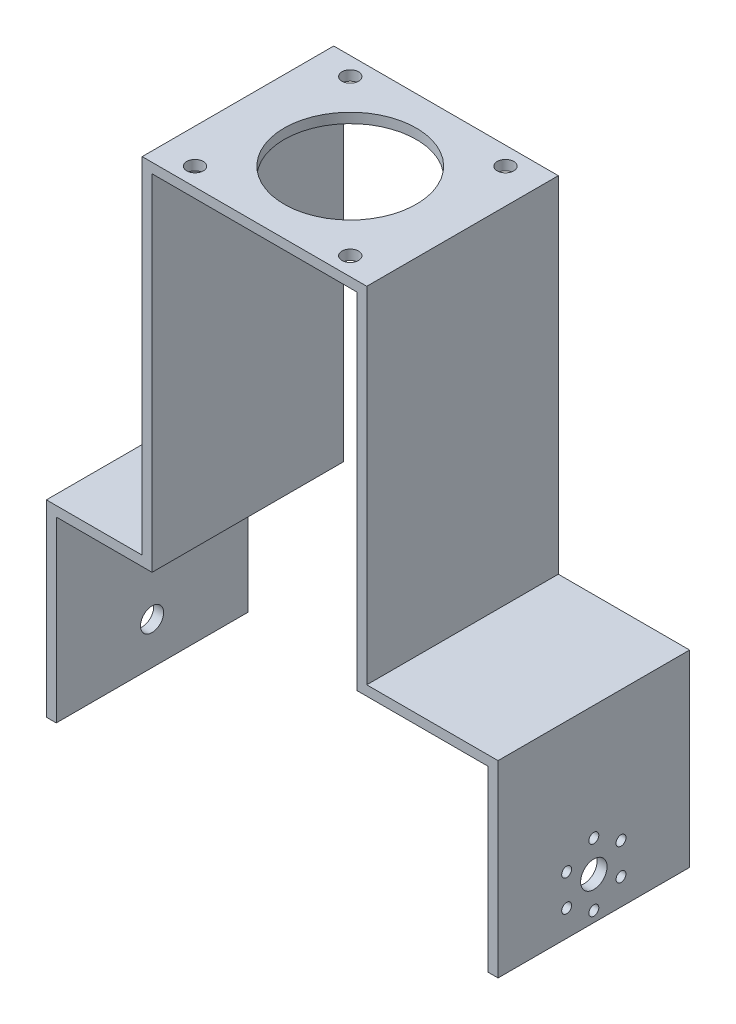
ISO-10303-21;
HEADER;
FILE_DESCRIPTION(('STEP AP214'),'2;1');
FILE_NAME('part.step','',(''),(''),'','','');
FILE_SCHEMA(('AUTOMOTIVE_DESIGN { 1 0 10303 214 1 1 1 1 }'));
ENDSEC;
DATA;
#1=APPLICATION_CONTEXT('core data for automotive mechanical design processes');
#2=APPLICATION_PROTOCOL_DEFINITION('international standard','automotive_design',2000,#1);
#3=PRODUCT_CONTEXT('',#1,'mechanical');
#4=PRODUCT('Part','Part','',(#3));
#5=PRODUCT_RELATED_PRODUCT_CATEGORY('part','',(#4));
#6=PRODUCT_DEFINITION_FORMATION('','',#4);
#7=PRODUCT_DEFINITION_CONTEXT('part definition',#1,'design');
#8=PRODUCT_DEFINITION('design','',#6,#7);
#9=PRODUCT_DEFINITION_SHAPE('','',#8);
#10=(LENGTH_UNIT() NAMED_UNIT(*) SI_UNIT(.MILLI.,.METRE.));
#11=(NAMED_UNIT(*) PLANE_ANGLE_UNIT() SI_UNIT($,.RADIAN.));
#12=(NAMED_UNIT(*) SI_UNIT($,.STERADIAN.) SOLID_ANGLE_UNIT());
#13=UNCERTAINTY_MEASURE_WITH_UNIT(LENGTH_MEASURE(1.E-05),#10,'distance_accuracy_value','');
#14=(GEOMETRIC_REPRESENTATION_CONTEXT(3) GLOBAL_UNCERTAINTY_ASSIGNED_CONTEXT((#13)) GLOBAL_UNIT_ASSIGNED_CONTEXT((#10,
#11,#12)) REPRESENTATION_CONTEXT('',''));
#15=CARTESIAN_POINT('',(0.,0.,0.));
#16=DIRECTION('',(0.,0.,1.));
#17=DIRECTION('',(1.,0.,0.));
#18=AXIS2_PLACEMENT_3D('',#15,#16,#17);
#19=CARTESIAN_POINT('',(-32.,51.8967154618484,58.));
#20=DIRECTION('',(1.,0.,0.));
#21=DIRECTION('',(0.,1.,0.));
#22=AXIS2_PLACEMENT_3D('',#19,#20,#21);
#23=PLANE('',#22);
#24=DIRECTION('',(0.,-1.,0.));
#25=VECTOR('',#24,1.);
#26=CARTESIAN_POINT('',(-32.,51.8967154618484,0.));
#27=LINE('',#26,#25);
#28=CARTESIAN_POINT('',(-32.,51.8967154618484,0.));
#29=VERTEX_POINT('',#28);
#30=CARTESIAN_POINT('',(-32.,-52.6032845381516,0.));
#31=VERTEX_POINT('',#30);
#32=EDGE_CURVE('E182',#29,#31,#27,.T.);
#33=ORIENTED_EDGE('',*,*,#32,.T.);
#34=DIRECTION('',(0.,0.,-1.));
#35=VECTOR('',#34,1.);
#36=CARTESIAN_POINT('',(-32.,-52.6032845381516,58.));
#37=LINE('',#36,#35);
#38=CARTESIAN_POINT('',(-32.,-52.6032845381516,58.));
#39=VERTEX_POINT('',#38);
#40=EDGE_CURVE('E42',#39,#31,#37,.T.);
#41=ORIENTED_EDGE('',*,*,#40,.F.);
#42=DIRECTION('',(0.,-1.,0.));
#43=VECTOR('',#42,1.);
#44=CARTESIAN_POINT('',(-32.,51.8967154618484,58.));
#45=LINE('',#44,#43);
#46=CARTESIAN_POINT('',(-32.,51.8967154618484,58.));
#47=VERTEX_POINT('',#46);
#48=EDGE_CURVE('E118',#47,#39,#45,.T.);
#49=ORIENTED_EDGE('',*,*,#48,.F.);
#50=DIRECTION('',(0.,0.,-1.));
#51=VECTOR('',#50,1.);
#52=CARTESIAN_POINT('',(-32.,51.8967154618484,58.));
#53=LINE('',#52,#51);
#54=EDGE_CURVE('E11',#47,#29,#53,.T.);
#55=ORIENTED_EDGE('',*,*,#54,.T.);
#56=EDGE_LOOP('',(#33,#41,#49,#55));
#57=FACE_BOUND('',#56,.T.);
#58=ADVANCED_FACE('F33',(#57),#23,.F.);
#59=CARTESIAN_POINT('',(-32.,-52.6032845381516,58.));
#60=DIRECTION('',(0.,-1.,0.));
#61=DIRECTION('',(1.,0.,0.));
#62=AXIS2_PLACEMENT_3D('',#59,#60,#61);
#63=PLANE('',#62);
#64=DIRECTION('',(-1.,0.,0.));
#65=VECTOR('',#64,1.);
#66=CARTESIAN_POINT('',(-32.,-52.6032845381516,0.));
#67=LINE('',#66,#65);
#68=CARTESIAN_POINT('',(-61.,-52.6032845381516,0.));
#69=VERTEX_POINT('',#68);
#70=EDGE_CURVE('E184',#31,#69,#67,.T.);
#71=ORIENTED_EDGE('',*,*,#70,.T.);
#72=DIRECTION('',(0.,0.,-1.));
#73=VECTOR('',#72,1.);
#74=CARTESIAN_POINT('',(-61.,-52.6032845381516,58.));
#75=LINE('',#74,#73);
#76=CARTESIAN_POINT('',(-61.,-52.6032845381516,58.));
#77=VERTEX_POINT('',#76);
#78=EDGE_CURVE('E242',#77,#69,#75,.T.);
#79=ORIENTED_EDGE('',*,*,#78,.F.);
#80=DIRECTION('',(-1.,0.,0.));
#81=VECTOR('',#80,1.);
#82=CARTESIAN_POINT('',(-32.,-52.6032845381516,58.));
#83=LINE('',#82,#81);
#84=EDGE_CURVE('E251',#39,#77,#83,.T.);
#85=ORIENTED_EDGE('',*,*,#84,.F.);
#86=ORIENTED_EDGE('',*,*,#40,.T.);
#87=EDGE_LOOP('',(#71,#79,#85,#86));
#88=FACE_BOUND('',#87,.T.);
#89=ADVANCED_FACE('F249',(#88),#63,.F.);
#90=CARTESIAN_POINT('',(-61.,-52.6032845381516,58.));
#91=DIRECTION('',(1.,0.,0.));
#92=DIRECTION('',(0.,0.,-1.));
#93=AXIS2_PLACEMENT_3D('',#90,#91,#92);
#94=PLANE('',#93);
#95=CARTESIAN_POINT('',(-61.,-96.9032845381516,29.));
#96=DIRECTION('',(-1.,0.,0.));
#97=DIRECTION('',(0.,0.,1.));
#98=AXIS2_PLACEMENT_3D('',#95,#96,#97);
#99=CIRCLE('',#98,3.5);
#100=CARTESIAN_POINT('',(-61.,-96.9032845381516,32.5));
#101=VERTEX_POINT('',#100);
#102=EDGE_CURVE('E302',#101,#101,#99,.T.);
#103=ORIENTED_EDGE('',*,*,#102,.F.);
#104=EDGE_LOOP('',(#103));
#105=FACE_BOUND('',#104,.T.);
#106=DIRECTION('',(0.,-1.,0.));
#107=VECTOR('',#106,1.);
#108=CARTESIAN_POINT('',(-61.,-52.6032845381516,0.));
#109=LINE('',#108,#107);
#110=CARTESIAN_POINT('',(-61.,-109.603284538152,0.));
#111=VERTEX_POINT('',#110);
#112=EDGE_CURVE('E186',#69,#111,#109,.T.);
#113=ORIENTED_EDGE('',*,*,#112,.T.);
#114=DIRECTION('',(0.,0.,-1.));
#115=VECTOR('',#114,1.);
#116=CARTESIAN_POINT('',(-61.,-109.603284538152,58.));
#117=LINE('',#116,#115);
#118=CARTESIAN_POINT('',(-61.,-109.603284538152,58.));
#119=VERTEX_POINT('',#118);
#120=EDGE_CURVE('E239',#119,#111,#117,.T.);
#121=ORIENTED_EDGE('',*,*,#120,.F.);
#122=DIRECTION('',(0.,-1.,0.));
#123=VECTOR('',#122,1.);
#124=CARTESIAN_POINT('',(-61.,-52.6032845381516,58.));
#125=LINE('',#124,#123);
#126=EDGE_CURVE('E270',#77,#119,#125,.T.);
#127=ORIENTED_EDGE('',*,*,#126,.F.);
#128=ORIENTED_EDGE('',*,*,#78,.T.);
#129=EDGE_LOOP('',(#113,#121,#127,#128));
#130=FACE_BOUND('',#129,.T.);
#131=ADVANCED_FACE('F261',(#105,#130),#94,.F.);
#132=CARTESIAN_POINT('',(-61.,-109.603284538152,58.));
#133=DIRECTION('',(0.,1.,0.));
#134=DIRECTION('',(0.,0.,1.));
#135=AXIS2_PLACEMENT_3D('',#132,#133,#134);
#136=PLANE('',#135);
#137=DIRECTION('',(1.,0.,0.));
#138=VECTOR('',#137,1.);
#139=CARTESIAN_POINT('',(-61.,-109.603284538152,0.));
#140=LINE('',#139,#138);
#141=CARTESIAN_POINT('',(-58.,-109.603284538152,0.));
#142=VERTEX_POINT('',#141);
#143=EDGE_CURVE('E188',#111,#142,#140,.T.);
#144=ORIENTED_EDGE('',*,*,#143,.T.);
#145=DIRECTION('',(0.,0.,-1.));
#146=VECTOR('',#145,1.);
#147=CARTESIAN_POINT('',(-58.,-109.603284538152,58.));
#148=LINE('',#147,#146);
#149=CARTESIAN_POINT('',(-58.,-109.603284538152,58.));
#150=VERTEX_POINT('',#149);
#151=EDGE_CURVE('E236',#150,#142,#148,.T.);
#152=ORIENTED_EDGE('',*,*,#151,.F.);
#153=DIRECTION('',(1.,0.,0.));
#154=VECTOR('',#153,1.);
#155=CARTESIAN_POINT('',(-61.,-109.603284538152,58.));
#156=LINE('',#155,#154);
#157=EDGE_CURVE('E267',#119,#150,#156,.T.);
#158=ORIENTED_EDGE('',*,*,#157,.F.);
#159=ORIENTED_EDGE('',*,*,#120,.T.);
#160=EDGE_LOOP('',(#144,#152,#158,#159));
#161=FACE_BOUND('',#160,.T.);
#162=ADVANCED_FACE('F265',(#161),#136,.F.);
#163=CARTESIAN_POINT('',(-58.,-55.6032845381516,58.));
#164=DIRECTION('',(-1.,0.,0.));
#165=DIRECTION('',(0.,0.,1.));
#166=AXIS2_PLACEMENT_3D('',#163,#164,#165);
#167=PLANE('',#166);
#168=CARTESIAN_POINT('',(-58.,-96.9032845381516,29.));
#169=DIRECTION('',(-1.,0.,0.));
#170=DIRECTION('',(0.,0.,1.));
#171=AXIS2_PLACEMENT_3D('',#168,#169,#170);
#172=CIRCLE('',#171,3.5);
#173=CARTESIAN_POINT('',(-58.,-96.9032845381516,32.5));
#174=VERTEX_POINT('',#173);
#175=EDGE_CURVE('E36',#174,#174,#172,.T.);
#176=ORIENTED_EDGE('',*,*,#175,.T.);
#177=EDGE_LOOP('',(#176));
#178=FACE_BOUND('',#177,.T.);
#179=DIRECTION('',(0.,1.,0.));
#180=VECTOR('',#179,1.);
#181=CARTESIAN_POINT('',(-58.,-55.6032845381516,0.));
#182=LINE('',#181,#180);
#183=CARTESIAN_POINT('',(-58.,-55.6032845381516,0.));
#184=VERTEX_POINT('',#183);
#185=EDGE_CURVE('E190',#142,#184,#182,.T.);
#186=ORIENTED_EDGE('',*,*,#185,.T.);
#187=DIRECTION('',(0.,0.,-1.));
#188=VECTOR('',#187,1.);
#189=CARTESIAN_POINT('',(-58.,-55.6032845381516,58.));
#190=LINE('',#189,#188);
#191=CARTESIAN_POINT('',(-58.,-55.6032845381516,58.));
#192=VERTEX_POINT('',#191);
#193=EDGE_CURVE('E233',#192,#184,#190,.T.);
#194=ORIENTED_EDGE('',*,*,#193,.F.);
#195=DIRECTION('',(0.,1.,0.));
#196=VECTOR('',#195,1.);
#197=CARTESIAN_POINT('',(-58.,-55.6032845381516,58.));
#198=LINE('',#197,#196);
#199=EDGE_CURVE('E269',#150,#192,#198,.T.);
#200=ORIENTED_EDGE('',*,*,#199,.F.);
#201=ORIENTED_EDGE('',*,*,#151,.T.);
#202=EDGE_LOOP('',(#186,#194,#200,#201));
#203=FACE_BOUND('',#202,.T.);
#204=ADVANCED_FACE('F439',(#178,#203),#167,.F.);
#205=CARTESIAN_POINT('',(-29.,-55.6032845381516,58.));
#206=DIRECTION('',(0.,1.,0.));
#207=DIRECTION('',(-1.,0.,0.));
#208=AXIS2_PLACEMENT_3D('',#205,#206,#207);
#209=PLANE('',#208);
#210=DIRECTION('',(1.,0.,0.));
#211=VECTOR('',#210,1.);
#212=CARTESIAN_POINT('',(-29.,-55.6032845381516,0.));
#213=LINE('',#212,#211);
#214=CARTESIAN_POINT('',(-29.,-55.6032845381516,0.));
#215=VERTEX_POINT('',#214);
#216=EDGE_CURVE('E192',#184,#215,#213,.T.);
#217=ORIENTED_EDGE('',*,*,#216,.T.);
#218=DIRECTION('',(0.,0.,-1.));
#219=VECTOR('',#218,1.);
#220=CARTESIAN_POINT('',(-29.,-55.6032845381516,58.));
#221=LINE('',#220,#219);
#222=CARTESIAN_POINT('',(-29.,-55.6032845381516,58.));
#223=VERTEX_POINT('',#222);
#224=EDGE_CURVE('E230',#223,#215,#221,.T.);
#225=ORIENTED_EDGE('',*,*,#224,.F.);
#226=DIRECTION('',(1.,0.,0.));
#227=VECTOR('',#226,1.);
#228=CARTESIAN_POINT('',(-29.,-55.6032845381516,58.));
#229=LINE('',#228,#227);
#230=EDGE_CURVE('E272',#192,#223,#229,.T.);
#231=ORIENTED_EDGE('',*,*,#230,.F.);
#232=ORIENTED_EDGE('',*,*,#193,.T.);
#233=EDGE_LOOP('',(#217,#225,#231,#232));
#234=FACE_BOUND('',#233,.T.);
#235=ADVANCED_FACE('F442',(#234),#209,.F.);
#236=CARTESIAN_POINT('',(-29.,48.8967154618484,58.));
#237=DIRECTION('',(-1.,0.,0.));
#238=DIRECTION('',(0.,-1.,0.));
#239=AXIS2_PLACEMENT_3D('',#236,#237,#238);
#240=PLANE('',#239);
#241=DIRECTION('',(0.,1.,0.));
#242=VECTOR('',#241,1.);
#243=CARTESIAN_POINT('',(-29.,48.8967154618484,0.));
#244=LINE('',#243,#242);
#245=CARTESIAN_POINT('',(-29.,48.8967154618484,0.));
#246=VERTEX_POINT('',#245);
#247=EDGE_CURVE('E194',#215,#246,#244,.T.);
#248=ORIENTED_EDGE('',*,*,#247,.T.);
#249=DIRECTION('',(0.,0.,-1.));
#250=VECTOR('',#249,1.);
#251=CARTESIAN_POINT('',(-29.,48.8967154618484,58.));
#252=LINE('',#251,#250);
#253=CARTESIAN_POINT('',(-29.,48.8967154618484,58.));
#254=VERTEX_POINT('',#253);
#255=EDGE_CURVE('E227',#254,#246,#252,.T.);
#256=ORIENTED_EDGE('',*,*,#255,.F.);
#257=DIRECTION('',(0.,1.,0.));
#258=VECTOR('',#257,1.);
#259=CARTESIAN_POINT('',(-29.,48.8967154618484,58.));
#260=LINE('',#259,#258);
#261=EDGE_CURVE('E278',#223,#254,#260,.T.);
#262=ORIENTED_EDGE('',*,*,#261,.F.);
#263=ORIENTED_EDGE('',*,*,#224,.T.);
#264=EDGE_LOOP('',(#248,#256,#262,#263));
#265=FACE_BOUND('',#264,.T.);
#266=ADVANCED_FACE('F404',(#265),#240,.F.);
#267=CARTESIAN_POINT('',(1.99999999999999,48.8967154618484,58.));
#268=DIRECTION('',(0.,1.,0.));
#269=DIRECTION('',(0.,0.,1.));
#270=AXIS2_PLACEMENT_3D('',#267,#268,#269);
#271=PLANE('',#270);
#272=CARTESIAN_POINT('',(-21.5,48.8967154618484,52.5));
#273=DIRECTION('',(0.,1.,0.));
#274=DIRECTION('',(0.,0.,1.));
#275=AXIS2_PLACEMENT_3D('',#272,#273,#274);
#276=CIRCLE('',#275,2.5);
#277=CARTESIAN_POINT('',(-21.5,48.8967154618484,55.));
#278=VERTEX_POINT('',#277);
#279=EDGE_CURVE('E371',#278,#278,#276,.T.);
#280=ORIENTED_EDGE('',*,*,#279,.T.);
#281=EDGE_LOOP('',(#280));
#282=FACE_BOUND('',#281,.T.);
#283=CARTESIAN_POINT('',(25.4999999999999,48.8967154618484,52.5));
#284=DIRECTION('',(0.,1.,0.));
#285=DIRECTION('',(0.,0.,1.));
#286=AXIS2_PLACEMENT_3D('',#283,#284,#285);
#287=CIRCLE('',#286,2.5);
#288=CARTESIAN_POINT('',(25.4999999999999,48.8967154618484,55.));
#289=VERTEX_POINT('',#288);
#290=EDGE_CURVE('E365',#289,#289,#287,.T.);
#291=ORIENTED_EDGE('',*,*,#290,.T.);
#292=EDGE_LOOP('',(#291));
#293=FACE_BOUND('',#292,.T.);
#294=CARTESIAN_POINT('',(25.4999999999999,48.8967154618484,5.5));
#295=DIRECTION('',(0.,1.,0.));
#296=DIRECTION('',(0.,0.,1.));
#297=AXIS2_PLACEMENT_3D('',#294,#295,#296);
#298=CIRCLE('',#297,2.5);
#299=CARTESIAN_POINT('',(25.4999999999999,48.8967154618484,7.99999999999999));
#300=VERTEX_POINT('',#299);
#301=EDGE_CURVE('E359',#300,#300,#298,.T.);
#302=ORIENTED_EDGE('',*,*,#301,.T.);
#303=EDGE_LOOP('',(#302));
#304=FACE_BOUND('',#303,.T.);
#305=CARTESIAN_POINT('',(-21.5,48.8967154618484,5.5));
#306=DIRECTION('',(0.,1.,0.));
#307=DIRECTION('',(0.,0.,1.));
#308=AXIS2_PLACEMENT_3D('',#305,#306,#307);
#309=CIRCLE('',#308,2.5);
#310=CARTESIAN_POINT('',(-21.5,48.8967154618484,8.));
#311=VERTEX_POINT('',#310);
#312=EDGE_CURVE('E353',#311,#311,#309,.T.);
#313=ORIENTED_EDGE('',*,*,#312,.T.);
#314=EDGE_LOOP('',(#313));
#315=FACE_BOUND('',#314,.T.);
#316=CARTESIAN_POINT('',(1.99999999999998,48.8967154618484,29.));
#317=DIRECTION('',(0.,1.,0.));
#318=DIRECTION('',(0.,0.,1.));
#319=AXIS2_PLACEMENT_3D('',#316,#317,#318);
#320=CIRCLE('',#319,20.);
#321=CARTESIAN_POINT('',(1.99999999999998,48.8967154618484,49.));
#322=VERTEX_POINT('',#321);
#323=EDGE_CURVE('E347',#322,#322,#320,.T.);
#324=ORIENTED_EDGE('',*,*,#323,.T.);
#325=EDGE_LOOP('',(#324));
#326=FACE_BOUND('',#325,.T.);
#327=DIRECTION('',(1.,0.,0.));
#328=VECTOR('',#327,1.);
#329=CARTESIAN_POINT('',(1.99999999999999,48.8967154618484,0.));
#330=LINE('',#329,#328);
#331=CARTESIAN_POINT('',(33.,48.8967154618484,0.));
#332=VERTEX_POINT('',#331);
#333=EDGE_CURVE('E197',#246,#332,#330,.T.);
#334=ORIENTED_EDGE('',*,*,#333,.T.);
#335=DIRECTION('',(0.,0.,-1.));
#336=VECTOR('',#335,1.);
#337=CARTESIAN_POINT('',(33.,48.8967154618484,58.));
#338=LINE('',#337,#336);
#339=CARTESIAN_POINT('',(33.,48.8967154618484,58.));
#340=VERTEX_POINT('',#339);
#341=EDGE_CURVE('E224',#340,#332,#338,.T.);
#342=ORIENTED_EDGE('',*,*,#341,.F.);
#343=DIRECTION('',(1.,0.,0.));
#344=VECTOR('',#343,1.);
#345=CARTESIAN_POINT('',(1.99999999999999,48.8967154618484,58.));
#346=LINE('',#345,#344);
#347=EDGE_CURVE('E280',#254,#340,#346,.T.);
#348=ORIENTED_EDGE('',*,*,#347,.F.);
#349=ORIENTED_EDGE('',*,*,#255,.T.);
#350=EDGE_LOOP('',(#334,#342,#348,#349));
#351=FACE_BOUND('',#350,.T.);
#352=ADVANCED_FACE('F400',(#282,#293,#304,#315,#326,#351),#271,.F.);
#353=CARTESIAN_POINT('',(33.,48.8967154618484,58.));
#354=DIRECTION('',(1.,0.,0.));
#355=DIRECTION('',(0.,1.,0.));
#356=AXIS2_PLACEMENT_3D('',#353,#354,#355);
#357=PLANE('',#356);
#358=DIRECTION('',(0.,-1.,0.));
#359=VECTOR('',#358,1.);
#360=CARTESIAN_POINT('',(33.,48.8967154618484,0.));
#361=LINE('',#360,#359);
#362=CARTESIAN_POINT('',(33.,-55.6032845381516,0.));
#363=VERTEX_POINT('',#362);
#364=EDGE_CURVE('E199',#332,#363,#361,.T.);
#365=ORIENTED_EDGE('',*,*,#364,.T.);
#366=DIRECTION('',(0.,0.,-1.));
#367=VECTOR('',#366,1.);
#368=CARTESIAN_POINT('',(33.,-55.6032845381516,58.));
#369=LINE('',#368,#367);
#370=CARTESIAN_POINT('',(33.,-55.6032845381516,58.));
#371=VERTEX_POINT('',#370);
#372=EDGE_CURVE('E221',#371,#363,#369,.T.);
#373=ORIENTED_EDGE('',*,*,#372,.F.);
#374=DIRECTION('',(0.,-1.,0.));
#375=VECTOR('',#374,1.);
#376=CARTESIAN_POINT('',(33.,48.8967154618484,58.));
#377=LINE('',#376,#375);
#378=EDGE_CURVE('E282',#340,#371,#377,.T.);
#379=ORIENTED_EDGE('',*,*,#378,.F.);
#380=ORIENTED_EDGE('',*,*,#341,.T.);
#381=EDGE_LOOP('',(#365,#373,#379,#380));
#382=FACE_BOUND('',#381,.T.);
#383=ADVANCED_FACE('F403',(#382),#357,.F.);
#384=CARTESIAN_POINT('',(33.,-55.6032845381516,58.));
#385=DIRECTION('',(0.,1.,0.));
#386=DIRECTION('',(0.,0.,1.));
#387=AXIS2_PLACEMENT_3D('',#384,#385,#386);
#388=PLANE('',#387);
#389=DIRECTION('',(1.,0.,0.));
#390=VECTOR('',#389,1.);
#391=CARTESIAN_POINT('',(33.,-55.6032845381516,0.));
#392=LINE('',#391,#390);
#393=CARTESIAN_POINT('',(72.75,-55.6032845381516,0.));
#394=VERTEX_POINT('',#393);
#395=EDGE_CURVE('E201',#363,#394,#392,.T.);
#396=ORIENTED_EDGE('',*,*,#395,.T.);
#397=DIRECTION('',(0.,0.,-1.));
#398=VECTOR('',#397,1.);
#399=CARTESIAN_POINT('',(72.75,-55.6032845381516,58.));
#400=LINE('',#399,#398);
#401=CARTESIAN_POINT('',(72.75,-55.6032845381516,58.));
#402=VERTEX_POINT('',#401);
#403=EDGE_CURVE('E218',#402,#394,#400,.T.);
#404=ORIENTED_EDGE('',*,*,#403,.F.);
#405=DIRECTION('',(1.,0.,0.));
#406=VECTOR('',#405,1.);
#407=CARTESIAN_POINT('',(33.,-55.6032845381516,58.));
#408=LINE('',#407,#406);
#409=EDGE_CURVE('E284',#371,#402,#408,.T.);
#410=ORIENTED_EDGE('',*,*,#409,.F.);
#411=ORIENTED_EDGE('',*,*,#372,.T.);
#412=EDGE_LOOP('',(#396,#404,#410,#411));
#413=FACE_BOUND('',#412,.T.);
#414=ADVANCED_FACE('F417',(#413),#388,.F.);
#415=CARTESIAN_POINT('',(72.75,-55.6032845381516,58.));
#416=DIRECTION('',(1.,0.,0.));
#417=DIRECTION('',(0.,1.,0.));
#418=AXIS2_PLACEMENT_3D('',#415,#416,#417);
#419=PLANE('',#418);
#420=CARTESIAN_POINT('',(72.75,-92.1524399232922,37.2272413359512));
#421=DIRECTION('',(1.,0.,0.));
#422=DIRECTION('',(0.,1.,0.));
#423=AXIS2_PLACEMENT_3D('',#420,#421,#422);
#424=CIRCLE('',#423,1.5);
#425=CARTESIAN_POINT('',(72.75,-90.6524399232922,37.2272413359512));
#426=VERTEX_POINT('',#425);
#427=EDGE_CURVE('E341',#426,#426,#424,.T.);
#428=ORIENTED_EDGE('',*,*,#427,.T.);
#429=EDGE_LOOP('',(#428));
#430=FACE_BOUND('',#429,.T.);
#431=CARTESIAN_POINT('',(72.75,-101.652439923292,37.2272413359495));
#432=DIRECTION('',(1.,0.,0.));
#433=DIRECTION('',(0.,1.,0.));
#434=AXIS2_PLACEMENT_3D('',#431,#432,#433);
#435=CIRCLE('',#434,1.5);
#436=CARTESIAN_POINT('',(72.75,-100.152439923292,37.2272413359495));
#437=VERTEX_POINT('',#436);
#438=EDGE_CURVE('E335',#437,#437,#435,.T.);
#439=ORIENTED_EDGE('',*,*,#438,.T.);
#440=EDGE_LOOP('',(#439));
#441=FACE_BOUND('',#440,.T.);
#442=CARTESIAN_POINT('',(72.75,-106.402439923291,28.9999999999964));
#443=DIRECTION('',(1.,0.,0.));
#444=DIRECTION('',(0.,1.,0.));
#445=AXIS2_PLACEMENT_3D('',#442,#443,#444);
#446=CIRCLE('',#445,1.5);
#447=CARTESIAN_POINT('',(72.75,-104.902439923291,28.9999999999964));
#448=VERTEX_POINT('',#447);
#449=EDGE_CURVE('E329',#448,#448,#446,.T.);
#450=ORIENTED_EDGE('',*,*,#449,.T.);
#451=EDGE_LOOP('',(#450));
#452=FACE_BOUND('',#451,.T.);
#453=CARTESIAN_POINT('',(72.75,-101.652439923289,20.7727586640451));
#454=DIRECTION('',(1.,0.,0.));
#455=DIRECTION('',(0.,1.,0.));
#456=AXIS2_PLACEMENT_3D('',#453,#454,#455);
#457=CIRCLE('',#456,1.5);
#458=CARTESIAN_POINT('',(72.75,-100.152439923289,20.7727586640451));
#459=VERTEX_POINT('',#458);
#460=EDGE_CURVE('E323',#459,#459,#457,.T.);
#461=ORIENTED_EDGE('',*,*,#460,.T.);
#462=EDGE_LOOP('',(#461));
#463=FACE_BOUND('',#462,.T.);
#464=CARTESIAN_POINT('',(72.75,-92.1524399232892,20.7727586640469));
#465=DIRECTION('',(1.,0.,0.));
#466=DIRECTION('',(0.,1.,0.));
#467=AXIS2_PLACEMENT_3D('',#464,#465,#466);
#468=CIRCLE('',#467,1.5);
#469=CARTESIAN_POINT('',(72.75,-90.6524399232892,20.7727586640469));
#470=VERTEX_POINT('',#469);
#471=EDGE_CURVE('E317',#470,#470,#468,.T.);
#472=ORIENTED_EDGE('',*,*,#471,.T.);
#473=EDGE_LOOP('',(#472));
#474=FACE_BOUND('',#473,.T.);
#475=CARTESIAN_POINT('',(72.75,-87.4024399232907,29.));
#476=DIRECTION('',(1.,0.,0.));
#477=DIRECTION('',(0.,1.,0.));
#478=AXIS2_PLACEMENT_3D('',#475,#476,#477);
#479=CIRCLE('',#478,1.5);
#480=CARTESIAN_POINT('',(72.75,-85.9024399232907,29.));
#481=VERTEX_POINT('',#480);
#482=EDGE_CURVE('E311',#481,#481,#479,.T.);
#483=ORIENTED_EDGE('',*,*,#482,.T.);
#484=EDGE_LOOP('',(#483));
#485=FACE_BOUND('',#484,.T.);
#486=CARTESIAN_POINT('',(72.75,-96.9024399232907,29.));
#487=DIRECTION('',(1.,0.,0.));
#488=DIRECTION('',(0.,1.,0.));
#489=AXIS2_PLACEMENT_3D('',#486,#487,#488);
#490=CIRCLE('',#489,4.);
#491=CARTESIAN_POINT('',(72.75,-92.9024399232907,29.));
#492=VERTEX_POINT('',#491);
#493=EDGE_CURVE('E305',#492,#492,#490,.T.);
#494=ORIENTED_EDGE('',*,*,#493,.T.);
#495=EDGE_LOOP('',(#494));
#496=FACE_BOUND('',#495,.T.);
#497=DIRECTION('',(0.,-1.,0.));
#498=VECTOR('',#497,1.);
#499=CARTESIAN_POINT('',(72.75,-55.6032845381516,0.));
#500=LINE('',#499,#498);
#501=CARTESIAN_POINT('',(72.75,-109.603284538152,0.));
#502=VERTEX_POINT('',#501);
#503=EDGE_CURVE('E203',#394,#502,#500,.T.);
#504=ORIENTED_EDGE('',*,*,#503,.T.);
#505=DIRECTION('',(0.,0.,-1.));
#506=VECTOR('',#505,1.);
#507=CARTESIAN_POINT('',(72.75,-109.603284538152,58.));
#508=LINE('',#507,#506);
#509=CARTESIAN_POINT('',(72.75,-109.603284538152,58.));
#510=VERTEX_POINT('',#509);
#511=EDGE_CURVE('E215',#510,#502,#508,.T.);
#512=ORIENTED_EDGE('',*,*,#511,.F.);
#513=DIRECTION('',(0.,-1.,0.));
#514=VECTOR('',#513,1.);
#515=CARTESIAN_POINT('',(72.75,-55.6032845381516,58.));
#516=LINE('',#515,#514);
#517=EDGE_CURVE('E286',#402,#510,#516,.T.);
#518=ORIENTED_EDGE('',*,*,#517,.F.);
#519=ORIENTED_EDGE('',*,*,#403,.T.);
#520=EDGE_LOOP('',(#504,#512,#518,#519));
#521=FACE_BOUND('',#520,.T.);
#522=ADVANCED_FACE('F292',(#430,#441,#452,#463,#474,#485,#496,#521),#419,.F.);
#523=CARTESIAN_POINT('',(72.75,-109.603284538152,58.));
#524=DIRECTION('',(0.,1.,0.));
#525=DIRECTION('',(0.,0.,1.));
#526=AXIS2_PLACEMENT_3D('',#523,#524,#525);
#527=PLANE('',#526);
#528=DIRECTION('',(1.,0.,0.));
#529=VECTOR('',#528,1.);
#530=CARTESIAN_POINT('',(72.75,-109.603284538152,0.));
#531=LINE('',#530,#529);
#532=CARTESIAN_POINT('',(75.75,-109.603284538152,0.));
#533=VERTEX_POINT('',#532);
#534=EDGE_CURVE('E205',#502,#533,#531,.T.);
#535=ORIENTED_EDGE('',*,*,#534,.T.);
#536=DIRECTION('',(0.,0.,-1.));
#537=VECTOR('',#536,1.);
#538=CARTESIAN_POINT('',(75.75,-109.603284538152,58.));
#539=LINE('',#538,#537);
#540=CARTESIAN_POINT('',(75.75,-109.603284538152,58.));
#541=VERTEX_POINT('',#540);
#542=EDGE_CURVE('E171',#541,#533,#539,.T.);
#543=ORIENTED_EDGE('',*,*,#542,.F.);
#544=DIRECTION('',(1.,0.,0.));
#545=VECTOR('',#544,1.);
#546=CARTESIAN_POINT('',(72.75,-109.603284538152,58.));
#547=LINE('',#546,#545);
#548=EDGE_CURVE('E162',#510,#541,#547,.T.);
#549=ORIENTED_EDGE('',*,*,#548,.F.);
#550=ORIENTED_EDGE('',*,*,#511,.T.);
#551=EDGE_LOOP('',(#535,#543,#549,#550));
#552=FACE_BOUND('',#551,.T.);
#553=ADVANCED_FACE('F296',(#552),#527,.F.);
#554=CARTESIAN_POINT('',(75.75,-52.6032845381516,58.));
#555=DIRECTION('',(-1.,0.,0.));
#556=DIRECTION('',(0.,-1.,0.));
#557=AXIS2_PLACEMENT_3D('',#554,#555,#556);
#558=PLANE('',#557);
#559=CARTESIAN_POINT('',(75.7500000000001,-92.1524399232922,37.2272413359512));
#560=DIRECTION('',(1.,0.,0.));
#561=DIRECTION('',(0.,1.,0.));
#562=AXIS2_PLACEMENT_3D('',#559,#560,#561);
#563=CIRCLE('',#562,1.5);
#564=CARTESIAN_POINT('',(75.7500000000001,-90.6524399232922,37.2272413359512));
#565=VERTEX_POINT('',#564);
#566=EDGE_CURVE('E344',#565,#565,#563,.T.);
#567=ORIENTED_EDGE('',*,*,#566,.F.);
#568=EDGE_LOOP('',(#567));
#569=FACE_BOUND('',#568,.T.);
#570=CARTESIAN_POINT('',(75.7500000000001,-101.652439923292,37.2272413359495));
#571=DIRECTION('',(1.,0.,0.));
#572=DIRECTION('',(0.,1.,0.));
#573=AXIS2_PLACEMENT_3D('',#570,#571,#572);
#574=CIRCLE('',#573,1.5);
#575=CARTESIAN_POINT('',(75.7500000000001,-100.152439923292,37.2272413359495));
#576=VERTEX_POINT('',#575);
#577=EDGE_CURVE('E338',#576,#576,#574,.T.);
#578=ORIENTED_EDGE('',*,*,#577,.F.);
#579=EDGE_LOOP('',(#578));
#580=FACE_BOUND('',#579,.T.);
#581=CARTESIAN_POINT('',(75.7500000000001,-106.402439923291,28.9999999999964));
#582=DIRECTION('',(1.,0.,0.));
#583=DIRECTION('',(0.,1.,0.));
#584=AXIS2_PLACEMENT_3D('',#581,#582,#583);
#585=CIRCLE('',#584,1.5);
#586=CARTESIAN_POINT('',(75.7500000000001,-104.902439923291,28.9999999999964));
#587=VERTEX_POINT('',#586);
#588=EDGE_CURVE('E332',#587,#587,#585,.T.);
#589=ORIENTED_EDGE('',*,*,#588,.F.);
#590=EDGE_LOOP('',(#589));
#591=FACE_BOUND('',#590,.T.);
#592=CARTESIAN_POINT('',(75.7500000000001,-101.652439923289,20.7727586640451));
#593=DIRECTION('',(1.,0.,0.));
#594=DIRECTION('',(0.,1.,0.));
#595=AXIS2_PLACEMENT_3D('',#592,#593,#594);
#596=CIRCLE('',#595,1.5);
#597=CARTESIAN_POINT('',(75.7500000000001,-100.152439923289,20.7727586640451));
#598=VERTEX_POINT('',#597);
#599=EDGE_CURVE('E326',#598,#598,#596,.T.);
#600=ORIENTED_EDGE('',*,*,#599,.F.);
#601=EDGE_LOOP('',(#600));
#602=FACE_BOUND('',#601,.T.);
#603=CARTESIAN_POINT('',(75.7500000000001,-92.1524399232892,20.7727586640469));
#604=DIRECTION('',(1.,0.,0.));
#605=DIRECTION('',(0.,1.,0.));
#606=AXIS2_PLACEMENT_3D('',#603,#604,#605);
#607=CIRCLE('',#606,1.5);
#608=CARTESIAN_POINT('',(75.7500000000001,-90.6524399232892,20.7727586640469));
#609=VERTEX_POINT('',#608);
#610=EDGE_CURVE('E320',#609,#609,#607,.T.);
#611=ORIENTED_EDGE('',*,*,#610,.F.);
#612=EDGE_LOOP('',(#611));
#613=FACE_BOUND('',#612,.T.);
#614=CARTESIAN_POINT('',(75.7500000000001,-87.4024399232907,29.));
#615=DIRECTION('',(1.,0.,0.));
#616=DIRECTION('',(0.,1.,0.));
#617=AXIS2_PLACEMENT_3D('',#614,#615,#616);
#618=CIRCLE('',#617,1.5);
#619=CARTESIAN_POINT('',(75.7500000000001,-85.9024399232907,29.));
#620=VERTEX_POINT('',#619);
#621=EDGE_CURVE('E314',#620,#620,#618,.T.);
#622=ORIENTED_EDGE('',*,*,#621,.F.);
#623=EDGE_LOOP('',(#622));
#624=FACE_BOUND('',#623,.T.);
#625=CARTESIAN_POINT('',(75.7500000000001,-96.9024399232907,29.));
#626=DIRECTION('',(1.,0.,0.));
#627=DIRECTION('',(0.,1.,0.));
#628=AXIS2_PLACEMENT_3D('',#625,#626,#627);
#629=CIRCLE('',#628,4.);
#630=CARTESIAN_POINT('',(75.7500000000001,-92.9024399232907,29.));
#631=VERTEX_POINT('',#630);
#632=EDGE_CURVE('E308',#631,#631,#629,.T.);
#633=ORIENTED_EDGE('',*,*,#632,.F.);
#634=EDGE_LOOP('',(#633));
#635=FACE_BOUND('',#634,.T.);
#636=DIRECTION('',(0.,1.,0.));
#637=VECTOR('',#636,1.);
#638=CARTESIAN_POINT('',(75.75,-52.6032845381516,0.));
#639=LINE('',#638,#637);
#640=CARTESIAN_POINT('',(75.75,-52.6032845381516,0.));
#641=VERTEX_POINT('',#640);
#642=EDGE_CURVE('E170',#533,#641,#639,.T.);
#643=ORIENTED_EDGE('',*,*,#642,.T.);
#644=DIRECTION('',(0.,0.,-1.));
#645=VECTOR('',#644,1.);
#646=CARTESIAN_POINT('',(75.75,-52.6032845381516,58.));
#647=LINE('',#646,#645);
#648=CARTESIAN_POINT('',(75.75,-52.6032845381516,58.));
#649=VERTEX_POINT('',#648);
#650=EDGE_CURVE('E167',#649,#641,#647,.T.);
#651=ORIENTED_EDGE('',*,*,#650,.F.);
#652=DIRECTION('',(0.,1.,0.));
#653=VECTOR('',#652,1.);
#654=CARTESIAN_POINT('',(75.75,-52.6032845381516,58.));
#655=LINE('',#654,#653);
#656=EDGE_CURVE('E156',#541,#649,#655,.T.);
#657=ORIENTED_EDGE('',*,*,#656,.F.);
#658=ORIENTED_EDGE('',*,*,#542,.T.);
#659=EDGE_LOOP('',(#643,#651,#657,#658));
#660=FACE_BOUND('',#659,.T.);
#661=ADVANCED_FACE('F168',(#569,#580,#591,#602,#613,#624,#635,#660),#558,.F.);
#662=CARTESIAN_POINT('',(36.,-52.6032845381516,58.));
#663=DIRECTION('',(0.,-1.,0.));
#664=DIRECTION('',(1.,0.,0.));
#665=AXIS2_PLACEMENT_3D('',#662,#663,#664);
#666=PLANE('',#665);
#667=DIRECTION('',(-1.,0.,0.));
#668=VECTOR('',#667,1.);
#669=CARTESIAN_POINT('',(36.,-52.6032845381516,0.));
#670=LINE('',#669,#668);
#671=CARTESIAN_POINT('',(36.,-52.6032845381516,0.));
#672=VERTEX_POINT('',#671);
#673=EDGE_CURVE('E104',#641,#672,#670,.T.);
#674=ORIENTED_EDGE('',*,*,#673,.T.);
#675=DIRECTION('',(0.,0.,-1.));
#676=VECTOR('',#675,1.);
#677=CARTESIAN_POINT('',(36.,-52.6032845381516,58.));
#678=LINE('',#677,#676);
#679=CARTESIAN_POINT('',(36.,-52.6032845381516,58.));
#680=VERTEX_POINT('',#679);
#681=EDGE_CURVE('E172',#680,#672,#678,.T.);
#682=ORIENTED_EDGE('',*,*,#681,.F.);
#683=DIRECTION('',(-1.,0.,0.));
#684=VECTOR('',#683,1.);
#685=CARTESIAN_POINT('',(36.,-52.6032845381516,58.));
#686=LINE('',#685,#684);
#687=EDGE_CURVE('E160',#649,#680,#686,.T.);
#688=ORIENTED_EDGE('',*,*,#687,.F.);
#689=ORIENTED_EDGE('',*,*,#650,.T.);
#690=EDGE_LOOP('',(#674,#682,#688,#689));
#691=FACE_BOUND('',#690,.T.);
#692=ADVANCED_FACE('F174',(#691),#666,.F.);
#693=CARTESIAN_POINT('',(36.,51.8967154618484,58.));
#694=DIRECTION('',(-1.,0.,0.));
#695=DIRECTION('',(0.,-1.,0.));
#696=AXIS2_PLACEMENT_3D('',#693,#694,#695);
#697=PLANE('',#696);
#698=DIRECTION('',(0.,1.,0.));
#699=VECTOR('',#698,1.);
#700=CARTESIAN_POINT('',(36.,51.8967154618484,0.));
#701=LINE('',#700,#699);
#702=CARTESIAN_POINT('',(36.,51.8967154618484,0.));
#703=VERTEX_POINT('',#702);
#704=EDGE_CURVE('E111',#672,#703,#701,.T.);
#705=ORIENTED_EDGE('',*,*,#704,.T.);
#706=DIRECTION('',(0.,0.,-1.));
#707=VECTOR('',#706,1.);
#708=CARTESIAN_POINT('',(36.,51.8967154618484,58.));
#709=LINE('',#708,#707);
#710=CARTESIAN_POINT('',(36.,51.8967154618484,58.));
#711=VERTEX_POINT('',#710);
#712=EDGE_CURVE('E178',#711,#703,#709,.T.);
#713=ORIENTED_EDGE('',*,*,#712,.F.);
#714=DIRECTION('',(0.,1.,0.));
#715=VECTOR('',#714,1.);
#716=CARTESIAN_POINT('',(36.,51.8967154618484,58.));
#717=LINE('',#716,#715);
#718=EDGE_CURVE('E176',#680,#711,#717,.T.);
#719=ORIENTED_EDGE('',*,*,#718,.F.);
#720=ORIENTED_EDGE('',*,*,#681,.T.);
#721=EDGE_LOOP('',(#705,#713,#719,#720));
#722=FACE_BOUND('',#721,.T.);
#723=ADVANCED_FACE('F298',(#722),#697,.F.);
#724=CARTESIAN_POINT('',(1.99999999999999,51.8967154618484,58.));
#725=DIRECTION('',(0.,-1.,0.));
#726=DIRECTION('',(1.,0.,0.));
#727=AXIS2_PLACEMENT_3D('',#724,#725,#726);
#728=PLANE('',#727);
#729=CARTESIAN_POINT('',(-21.5,51.8967154618484,52.5));
#730=DIRECTION('',(0.,1.,0.));
#731=DIRECTION('',(1.,0.,0.));
#732=AXIS2_PLACEMENT_3D('',#729,#730,#731);
#733=CIRCLE('',#732,2.5);
#734=CARTESIAN_POINT('',(-19.,51.8967154618484,52.5));
#735=VERTEX_POINT('',#734);
#736=EDGE_CURVE('E374',#735,#735,#733,.T.);
#737=ORIENTED_EDGE('',*,*,#736,.F.);
#738=EDGE_LOOP('',(#737));
#739=FACE_BOUND('',#738,.T.);
#740=CARTESIAN_POINT('',(25.4999999999999,51.8967154618484,52.5));
#741=DIRECTION('',(0.,1.,0.));
#742=DIRECTION('',(-1.,0.,0.));
#743=AXIS2_PLACEMENT_3D('',#740,#741,#742);
#744=CIRCLE('',#743,2.5);
#745=CARTESIAN_POINT('',(22.9999999999999,51.8967154618484,52.5));
#746=VERTEX_POINT('',#745);
#747=EDGE_CURVE('E368',#746,#746,#744,.T.);
#748=ORIENTED_EDGE('',*,*,#747,.F.);
#749=EDGE_LOOP('',(#748));
#750=FACE_BOUND('',#749,.T.);
#751=CARTESIAN_POINT('',(25.4999999999999,51.8967154618484,5.5));
#752=DIRECTION('',(0.,1.,0.));
#753=DIRECTION('',(1.,0.,0.));
#754=AXIS2_PLACEMENT_3D('',#751,#752,#753);
#755=CIRCLE('',#754,2.5);
#756=CARTESIAN_POINT('',(27.9999999999999,51.8967154618484,5.5));
#757=VERTEX_POINT('',#756);
#758=EDGE_CURVE('E362',#757,#757,#755,.T.);
#759=ORIENTED_EDGE('',*,*,#758,.F.);
#760=EDGE_LOOP('',(#759));
#761=FACE_BOUND('',#760,.T.);
#762=CARTESIAN_POINT('',(-21.5,51.8967154618484,5.5));
#763=DIRECTION('',(0.,1.,0.));
#764=DIRECTION('',(-1.,0.,0.));
#765=AXIS2_PLACEMENT_3D('',#762,#763,#764);
#766=CIRCLE('',#765,2.5);
#767=CARTESIAN_POINT('',(-24.,51.8967154618484,5.5));
#768=VERTEX_POINT('',#767);
#769=EDGE_CURVE('E356',#768,#768,#766,.T.);
#770=ORIENTED_EDGE('',*,*,#769,.F.);
#771=EDGE_LOOP('',(#770));
#772=FACE_BOUND('',#771,.T.);
#773=CARTESIAN_POINT('',(1.99999999999998,51.8967154618484,29.));
#774=DIRECTION('',(0.,1.,0.));
#775=DIRECTION('',(-1.,0.,0.));
#776=AXIS2_PLACEMENT_3D('',#773,#774,#775);
#777=CIRCLE('',#776,20.);
#778=CARTESIAN_POINT('',(-18.,51.8967154618484,29.));
#779=VERTEX_POINT('',#778);
#780=EDGE_CURVE('E350',#779,#779,#777,.T.);
#781=ORIENTED_EDGE('',*,*,#780,.F.);
#782=EDGE_LOOP('',(#781));
#783=FACE_BOUND('',#782,.T.);
#784=DIRECTION('',(-1.,0.,0.));
#785=VECTOR('',#784,1.);
#786=CARTESIAN_POINT('',(1.99999999999999,51.8967154618484,0.));
#787=LINE('',#786,#785);
#788=EDGE_CURVE('E210',#703,#29,#787,.T.);
#789=ORIENTED_EDGE('',*,*,#788,.T.);
#790=ORIENTED_EDGE('',*,*,#54,.F.);
#791=DIRECTION('',(-1.,0.,0.));
#792=VECTOR('',#791,1.);
#793=CARTESIAN_POINT('',(1.99999999999999,51.8967154618484,58.));
#794=LINE('',#793,#792);
#795=EDGE_CURVE('E50',#711,#47,#794,.T.);
#796=ORIENTED_EDGE('',*,*,#795,.F.);
#797=ORIENTED_EDGE('',*,*,#712,.T.);
#798=EDGE_LOOP('',(#789,#790,#796,#797));
#799=FACE_BOUND('',#798,.T.);
#800=ADVANCED_FACE('F297',(#739,#750,#761,#772,#783,#799),#728,.F.);
#801=CARTESIAN_POINT('',(0.,0.,58.));
#802=DIRECTION('',(0.,0.,1.));
#803=DIRECTION('',(1.,0.,0.));
#804=AXIS2_PLACEMENT_3D('',#801,#802,#803);
#805=PLANE('',#804);
#806=ORIENTED_EDGE('',*,*,#795,.T.);
#807=ORIENTED_EDGE('',*,*,#48,.T.);
#808=ORIENTED_EDGE('',*,*,#84,.T.);
#809=ORIENTED_EDGE('',*,*,#126,.T.);
#810=ORIENTED_EDGE('',*,*,#157,.T.);
#811=ORIENTED_EDGE('',*,*,#199,.T.);
#812=ORIENTED_EDGE('',*,*,#230,.T.);
#813=ORIENTED_EDGE('',*,*,#261,.T.);
#814=ORIENTED_EDGE('',*,*,#347,.T.);
#815=ORIENTED_EDGE('',*,*,#378,.T.);
#816=ORIENTED_EDGE('',*,*,#409,.T.);
#817=ORIENTED_EDGE('',*,*,#517,.T.);
#818=ORIENTED_EDGE('',*,*,#548,.T.);
#819=ORIENTED_EDGE('',*,*,#656,.T.);
#820=ORIENTED_EDGE('',*,*,#687,.T.);
#821=ORIENTED_EDGE('',*,*,#718,.T.);
#822=EDGE_LOOP('',(#806,#807,#808,#809,#810,#811,#812,#813,#814,#815,#816,#817,#818,#819,#820,#821));
#823=FACE_BOUND('',#822,.T.);
#824=ADVANCED_FACE('F158',(#823),#805,.T.);
#825=CARTESIAN_POINT('',(0.,0.,0.));
#826=DIRECTION('',(0.,0.,1.));
#827=DIRECTION('',(1.,0.,0.));
#828=AXIS2_PLACEMENT_3D('',#825,#826,#827);
#829=PLANE('',#828);
#830=ORIENTED_EDGE('',*,*,#32,.F.);
#831=ORIENTED_EDGE('',*,*,#788,.F.);
#832=ORIENTED_EDGE('',*,*,#704,.F.);
#833=ORIENTED_EDGE('',*,*,#673,.F.);
#834=ORIENTED_EDGE('',*,*,#642,.F.);
#835=ORIENTED_EDGE('',*,*,#534,.F.);
#836=ORIENTED_EDGE('',*,*,#503,.F.);
#837=ORIENTED_EDGE('',*,*,#395,.F.);
#838=ORIENTED_EDGE('',*,*,#364,.F.);
#839=ORIENTED_EDGE('',*,*,#333,.F.);
#840=ORIENTED_EDGE('',*,*,#247,.F.);
#841=ORIENTED_EDGE('',*,*,#216,.F.);
#842=ORIENTED_EDGE('',*,*,#185,.F.);
#843=ORIENTED_EDGE('',*,*,#143,.F.);
#844=ORIENTED_EDGE('',*,*,#112,.F.);
#845=ORIENTED_EDGE('',*,*,#70,.F.);
#846=EDGE_LOOP('',(#830,#831,#832,#833,#834,#835,#836,#837,#838,#839,#840,#841,#842,#843,#844,#845));
#847=FACE_BOUND('',#846,.T.);
#848=ADVANCED_FACE('F255',(#847),#829,.F.);
#849=CARTESIAN_POINT('',(-3.,-96.9032845381516,29.));
#850=DIRECTION('',(-1.,0.,0.));
#851=DIRECTION('',(0.,0.,1.));
#852=AXIS2_PLACEMENT_3D('',#849,#850,#851);
#853=CYLINDRICAL_SURFACE('',#852,3.5);
#854=ORIENTED_EDGE('',*,*,#102,.T.);
#855=EDGE_LOOP('',(#854));
#856=FACE_BOUND('',#855,.T.);
#857=ORIENTED_EDGE('',*,*,#175,.F.);
#858=EDGE_LOOP('',(#857));
#859=FACE_BOUND('',#858,.T.);
#860=ADVANCED_FACE('F519',(#856,#859),#853,.F.);
#861=CARTESIAN_POINT('',(65.7500000000001,-96.9024399232907,29.));
#862=DIRECTION('',(1.,0.,0.));
#863=DIRECTION('',(0.,1.,0.));
#864=AXIS2_PLACEMENT_3D('',#861,#862,#863);
#865=CYLINDRICAL_SURFACE('',#864,4.);
#866=ORIENTED_EDGE('',*,*,#632,.T.);
#867=EDGE_LOOP('',(#866));
#868=FACE_BOUND('',#867,.T.);
#869=ORIENTED_EDGE('',*,*,#493,.F.);
#870=EDGE_LOOP('',(#869));
#871=FACE_BOUND('',#870,.T.);
#872=ADVANCED_FACE('F543',(#868,#871),#865,.F.);
#873=CARTESIAN_POINT('',(65.7500000000001,-87.4024399232907,29.));
#874=DIRECTION('',(1.,0.,0.));
#875=DIRECTION('',(0.,1.,0.));
#876=AXIS2_PLACEMENT_3D('',#873,#874,#875);
#877=CYLINDRICAL_SURFACE('',#876,1.5);
#878=ORIENTED_EDGE('',*,*,#621,.T.);
#879=EDGE_LOOP('',(#878));
#880=FACE_BOUND('',#879,.T.);
#881=ORIENTED_EDGE('',*,*,#482,.F.);
#882=EDGE_LOOP('',(#881));
#883=FACE_BOUND('',#882,.T.);
#884=ADVANCED_FACE('F553',(#880,#883),#877,.F.);
#885=CARTESIAN_POINT('',(65.7500000000001,-92.1524399232892,20.7727586640469));
#886=DIRECTION('',(1.,0.,0.));
#887=DIRECTION('',(0.,1.,0.));
#888=AXIS2_PLACEMENT_3D('',#885,#886,#887);
#889=CYLINDRICAL_SURFACE('',#888,1.5);
#890=ORIENTED_EDGE('',*,*,#610,.T.);
#891=EDGE_LOOP('',(#890));
#892=FACE_BOUND('',#891,.T.);
#893=ORIENTED_EDGE('',*,*,#471,.F.);
#894=EDGE_LOOP('',(#893));
#895=FACE_BOUND('',#894,.T.);
#896=ADVANCED_FACE('F575',(#892,#895),#889,.F.);
#897=CARTESIAN_POINT('',(65.7500000000001,-101.652439923289,20.7727586640451));
#898=DIRECTION('',(1.,0.,0.));
#899=DIRECTION('',(0.,1.,0.));
#900=AXIS2_PLACEMENT_3D('',#897,#898,#899);
#901=CYLINDRICAL_SURFACE('',#900,1.5);
#902=ORIENTED_EDGE('',*,*,#599,.T.);
#903=EDGE_LOOP('',(#902));
#904=FACE_BOUND('',#903,.T.);
#905=ORIENTED_EDGE('',*,*,#460,.F.);
#906=EDGE_LOOP('',(#905));
#907=FACE_BOUND('',#906,.T.);
#908=ADVANCED_FACE('F585',(#904,#907),#901,.F.);
#909=CARTESIAN_POINT('',(65.7500000000001,-106.402439923291,28.9999999999964));
#910=DIRECTION('',(1.,0.,0.));
#911=DIRECTION('',(0.,1.,0.));
#912=AXIS2_PLACEMENT_3D('',#909,#910,#911);
#913=CYLINDRICAL_SURFACE('',#912,1.5);
#914=ORIENTED_EDGE('',*,*,#588,.T.);
#915=EDGE_LOOP('',(#914));
#916=FACE_BOUND('',#915,.T.);
#917=ORIENTED_EDGE('',*,*,#449,.F.);
#918=EDGE_LOOP('',(#917));
#919=FACE_BOUND('',#918,.T.);
#920=ADVANCED_FACE('F595',(#916,#919),#913,.F.);
#921=CARTESIAN_POINT('',(65.7500000000001,-101.652439923292,37.2272413359495));
#922=DIRECTION('',(1.,0.,0.));
#923=DIRECTION('',(0.,1.,0.));
#924=AXIS2_PLACEMENT_3D('',#921,#922,#923);
#925=CYLINDRICAL_SURFACE('',#924,1.5);
#926=ORIENTED_EDGE('',*,*,#577,.T.);
#927=EDGE_LOOP('',(#926));
#928=FACE_BOUND('',#927,.T.);
#929=ORIENTED_EDGE('',*,*,#438,.F.);
#930=EDGE_LOOP('',(#929));
#931=FACE_BOUND('',#930,.T.);
#932=ADVANCED_FACE('F605',(#928,#931),#925,.F.);
#933=CARTESIAN_POINT('',(65.7500000000001,-92.1524399232922,37.2272413359512));
#934=DIRECTION('',(1.,0.,0.));
#935=DIRECTION('',(0.,1.,0.));
#936=AXIS2_PLACEMENT_3D('',#933,#934,#935);
#937=CYLINDRICAL_SURFACE('',#936,1.5);
#938=ORIENTED_EDGE('',*,*,#566,.T.);
#939=EDGE_LOOP('',(#938));
#940=FACE_BOUND('',#939,.T.);
#941=ORIENTED_EDGE('',*,*,#427,.F.);
#942=EDGE_LOOP('',(#941));
#943=FACE_BOUND('',#942,.T.);
#944=ADVANCED_FACE('F396',(#940,#943),#937,.F.);
#945=CARTESIAN_POINT('',(1.99999999999998,41.8967154618484,29.));
#946=DIRECTION('',(0.,1.,0.));
#947=DIRECTION('',(-1.,0.,0.));
#948=AXIS2_PLACEMENT_3D('',#945,#946,#947);
#949=CYLINDRICAL_SURFACE('',#948,20.);
#950=ORIENTED_EDGE('',*,*,#780,.T.);
#951=EDGE_LOOP('',(#950));
#952=FACE_BOUND('',#951,.T.);
#953=ORIENTED_EDGE('',*,*,#323,.F.);
#954=EDGE_LOOP('',(#953));
#955=FACE_BOUND('',#954,.T.);
#956=ADVANCED_FACE('F392',(#952,#955),#949,.F.);
#957=CARTESIAN_POINT('',(-21.5,41.8967154618484,5.5));
#958=DIRECTION('',(0.,1.,0.));
#959=DIRECTION('',(-1.,0.,0.));
#960=AXIS2_PLACEMENT_3D('',#957,#958,#959);
#961=CYLINDRICAL_SURFACE('',#960,2.5);
#962=ORIENTED_EDGE('',*,*,#769,.T.);
#963=EDGE_LOOP('',(#962));
#964=FACE_BOUND('',#963,.T.);
#965=ORIENTED_EDGE('',*,*,#312,.F.);
#966=EDGE_LOOP('',(#965));
#967=FACE_BOUND('',#966,.T.);
#968=ADVANCED_FACE('F395',(#964,#967),#961,.F.);
#969=CARTESIAN_POINT('',(25.4999999999999,41.8967154618484,5.5));
#970=DIRECTION('',(0.,1.,0.));
#971=DIRECTION('',(-1.,0.,0.));
#972=AXIS2_PLACEMENT_3D('',#969,#970,#971);
#973=CYLINDRICAL_SURFACE('',#972,2.5);
#974=ORIENTED_EDGE('',*,*,#758,.T.);
#975=EDGE_LOOP('',(#974));
#976=FACE_BOUND('',#975,.T.);
#977=ORIENTED_EDGE('',*,*,#301,.F.);
#978=EDGE_LOOP('',(#977));
#979=FACE_BOUND('',#978,.T.);
#980=ADVANCED_FACE('F635',(#976,#979),#973,.F.);
#981=CARTESIAN_POINT('',(25.4999999999999,41.8967154618484,52.5));
#982=DIRECTION('',(0.,1.,0.));
#983=DIRECTION('',(-1.,0.,0.));
#984=AXIS2_PLACEMENT_3D('',#981,#982,#983);
#985=CYLINDRICAL_SURFACE('',#984,2.5);
#986=ORIENTED_EDGE('',*,*,#747,.T.);
#987=EDGE_LOOP('',(#986));
#988=FACE_BOUND('',#987,.T.);
#989=ORIENTED_EDGE('',*,*,#290,.F.);
#990=EDGE_LOOP('',(#989));
#991=FACE_BOUND('',#990,.T.);
#992=ADVANCED_FACE('F643',(#988,#991),#985,.F.);
#993=CARTESIAN_POINT('',(-21.5,41.8967154618484,52.5));
#994=DIRECTION('',(0.,1.,0.));
#995=DIRECTION('',(-1.,0.,0.));
#996=AXIS2_PLACEMENT_3D('',#993,#994,#995);
#997=CYLINDRICAL_SURFACE('',#996,2.5);
#998=ORIENTED_EDGE('',*,*,#736,.T.);
#999=EDGE_LOOP('',(#998));
#1000=FACE_BOUND('',#999,.T.);
#1001=ORIENTED_EDGE('',*,*,#279,.F.);
#1002=EDGE_LOOP('',(#1001));
#1003=FACE_BOUND('',#1002,.T.);
#1004=ADVANCED_FACE('F378',(#1000,#1003),#997,.F.);
#1005=CLOSED_SHELL('',(#58,#89,#131,#162,#204,#235,#266,#352,#383,#414,#522,#553,#661,#692,#723,
#800,#824,#848,#860,#872,#884,#896,#908,#920,#932,#944,#956,#968,#980,#992,#1004));
#1006=MANIFOLD_SOLID_BREP('B2',#1005);
#1007=ADVANCED_BREP_SHAPE_REPRESENTATION('',(#18,#1006),#14);
#1008=SHAPE_DEFINITION_REPRESENTATION(#9,#1007);
ENDSEC;
END-ISO-10303-21;
